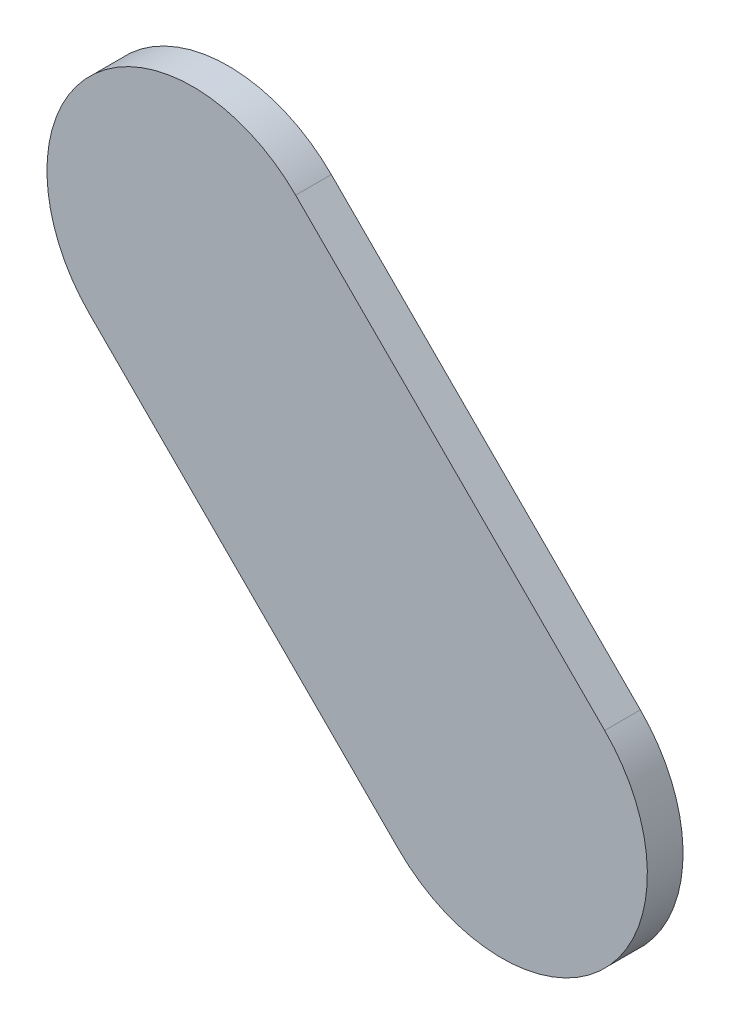
ISO-10303-21;
HEADER;
FILE_DESCRIPTION(('STEP AP214'),'2;1');
FILE_NAME('part.step','',(''),(''),'','','');
FILE_SCHEMA(('AUTOMOTIVE_DESIGN { 1 0 10303 214 1 1 1 1 }'));
ENDSEC;
DATA;
#1=APPLICATION_CONTEXT('core data for automotive mechanical design processes');
#2=APPLICATION_PROTOCOL_DEFINITION('international standard','automotive_design',2000,#1);
#3=PRODUCT_CONTEXT('',#1,'mechanical');
#4=PRODUCT('Part','Part','',(#3));
#5=PRODUCT_RELATED_PRODUCT_CATEGORY('part','',(#4));
#6=PRODUCT_DEFINITION_FORMATION('','',#4);
#7=PRODUCT_DEFINITION_CONTEXT('part definition',#1,'design');
#8=PRODUCT_DEFINITION('design','',#6,#7);
#9=PRODUCT_DEFINITION_SHAPE('','',#8);
#10=(LENGTH_UNIT() NAMED_UNIT(*) SI_UNIT(.MILLI.,.METRE.));
#11=(NAMED_UNIT(*) PLANE_ANGLE_UNIT() SI_UNIT($,.RADIAN.));
#12=(NAMED_UNIT(*) SI_UNIT($,.STERADIAN.) SOLID_ANGLE_UNIT());
#13=UNCERTAINTY_MEASURE_WITH_UNIT(LENGTH_MEASURE(1.E-05),#10,'distance_accuracy_value','');
#14=(GEOMETRIC_REPRESENTATION_CONTEXT(3) GLOBAL_UNCERTAINTY_ASSIGNED_CONTEXT((#13)) GLOBAL_UNIT_ASSIGNED_CONTEXT((#10,
#11,#12)) REPRESENTATION_CONTEXT('',''));
#15=CARTESIAN_POINT('',(0.,0.,0.));
#16=DIRECTION('',(0.,0.,1.));
#17=DIRECTION('',(1.,0.,0.));
#18=AXIS2_PLACEMENT_3D('',#15,#16,#17);
#19=CARTESIAN_POINT('',(3.018821666303,6.264377372288,0.76487));
#20=DIRECTION('',(0.,0.,-1.));
#21=DIRECTION('',(-1.,0.,0.));
#22=AXIS2_PLACEMENT_3D('',#19,#20,#21);
#23=PLANE('',#22);
#24=DIRECTION('',(0.707105987136602,-0.707107575235602,0.));
#25=VECTOR('',#24,1.);
#26=CARTESIAN_POINT('',(2.969431000001,6.511239,0.76487));
#27=LINE('',#26,#25);
#28=CARTESIAN_POINT('',(2.96943103026743,6.51123896973362,0.76487));
#29=VERTEX_POINT('',#28);
#30=CARTESIAN_POINT('',(3.26641555533316,6.21425377766617,0.76487));
#31=VERTEX_POINT('',#30);
#32=EDGE_CURVE('E54',#29,#31,#27,.T.);
#33=ORIENTED_EDGE('',*,*,#32,.T.);
#34=CARTESIAN_POINT('',(3.167420667,6.115258667,0.76487));
#35=DIRECTION('',(0.,0.,1.));
#36=DIRECTION('',(1.,0.,0.));
#37=AXIS2_PLACEMENT_3D('',#34,#35,#36);
#38=CIRCLE('',#37,0.140000070901);
#39=CARTESIAN_POINT('',(3.06842574790159,6.01626425310059,0.76487));
#40=VERTEX_POINT('',#39);
#41=EDGE_CURVE('E20',#40,#31,#38,.T.);
#42=ORIENTED_EDGE('',*,*,#41,.F.);
#43=DIRECTION('',(-0.707107575236102,0.707105987136102,0.));
#44=VECTOR('',#43,1.);
#45=CARTESIAN_POINT('',(3.068425667001,6.016264334001,0.76487));
#46=LINE('',#45,#44);
#47=CARTESIAN_POINT('',(2.77144055583361,6.31324877816655,0.76487));
#48=VERTEX_POINT('',#47);
#49=EDGE_CURVE('E78',#40,#48,#46,.T.);
#50=ORIENTED_EDGE('',*,*,#49,.T.);
#51=CARTESIAN_POINT('',(2.870435333,6.412244,0.76487));
#52=DIRECTION('',(0.,0.,1.));
#53=DIRECTION('',(1.,0.,0.));
#54=AXIS2_PLACEMENT_3D('',#51,#52,#53);
#55=CIRCLE('',#54,0.140000070901);
#56=EDGE_CURVE('E58',#29,#48,#55,.T.);
#57=ORIENTED_EDGE('',*,*,#56,.F.);
#58=EDGE_LOOP('',(#33,#42,#50,#57));
#59=FACE_BOUND('',#58,.T.);
#60=ADVANCED_FACE('F17',(#59),#23,.T.);
#61=CARTESIAN_POINT('',(3.167420667,6.115258667,0.76487));
#62=DIRECTION('',(0.,0.,1.));
#63=DIRECTION('',(1.,0.,0.));
#64=AXIS2_PLACEMENT_3D('',#61,#62,#63);
#65=CYLINDRICAL_SURFACE('',#64,0.140000070901);
#66=ORIENTED_EDGE('',*,*,#41,.T.);
#67=DIRECTION('',(0.,0.,1.));
#68=VECTOR('',#67,1.);
#69=CARTESIAN_POINT('',(3.26641533299991,6.21425399999992,0.76487));
#70=LINE('',#69,#68);
#71=CARTESIAN_POINT('',(3.26641555533319,6.21425377766623,0.79916));
#72=VERTEX_POINT('',#71);
#73=EDGE_CURVE('E62',#31,#72,#70,.T.);
#74=ORIENTED_EDGE('',*,*,#73,.T.);
#75=CARTESIAN_POINT('',(3.167420667001,6.115259232733,0.79916));
#76=DIRECTION('',(0.,0.,1.));
#77=DIRECTION('',(1.,0.,0.));
#78=AXIS2_PLACEMENT_3D('',#75,#76,#77);
#79=CIRCLE('',#78,0.14);
#80=CARTESIAN_POINT('',(3.06842574790162,6.01626425310056,0.79916));
#81=VERTEX_POINT('',#80);
#82=EDGE_CURVE('E82',#81,#72,#79,.T.);
#83=ORIENTED_EDGE('',*,*,#82,.F.);
#84=DIRECTION('',(0.,0.,1.));
#85=VECTOR('',#84,1.);
#86=CARTESIAN_POINT('',(3.068425667001,6.016264334001,0.76487));
#87=LINE('',#86,#85);
#88=EDGE_CURVE('E69',#81,#40,#87,.F.);
#89=ORIENTED_EDGE('',*,*,#88,.T.);
#90=EDGE_LOOP('',(#66,#74,#83,#89));
#91=FACE_BOUND('',#90,.T.);
#92=ADVANCED_FACE('F66',(#91),#65,.T.);
#93=CARTESIAN_POINT('',(2.969431000001,6.511239,0.76487));
#94=DIRECTION('',(-0.707107575235602,-0.707105987136602,0.));
#95=DIRECTION('',(0.707105987136602,-0.707107575235602,0.));
#96=AXIS2_PLACEMENT_3D('',#93,#94,#95);
#97=PLANE('',#96);
#98=ORIENTED_EDGE('',*,*,#73,.F.);
#99=ORIENTED_EDGE('',*,*,#32,.F.);
#100=DIRECTION('',(0.,0.,1.));
#101=VECTOR('',#100,1.);
#102=CARTESIAN_POINT('',(2.96943100000123,6.51123900000023,0.76487));
#103=LINE('',#102,#101);
#104=CARTESIAN_POINT('',(2.96943103026741,6.51123896973364,0.79916));
#105=VERTEX_POINT('',#104);
#106=EDGE_CURVE('E73',#105,#29,#103,.F.);
#107=ORIENTED_EDGE('',*,*,#106,.F.);
#108=DIRECTION('',(-0.707105987136807,0.707107575235396,0.));
#109=VECTOR('',#108,1.);
#110=CARTESIAN_POINT('',(3.266415333,6.214254,0.79916));
#111=LINE('',#110,#109);
#112=EDGE_CURVE('E72',#72,#105,#111,.T.);
#113=ORIENTED_EDGE('',*,*,#112,.F.);
#114=EDGE_LOOP('',(#98,#99,#107,#113));
#115=FACE_BOUND('',#114,.T.);
#116=ADVANCED_FACE('F71',(#115),#97,.F.);
#117=CARTESIAN_POINT('',(2.870435333,6.412244,0.76487));
#118=DIRECTION('',(0.,0.,1.));
#119=DIRECTION('',(1.,0.,0.));
#120=AXIS2_PLACEMENT_3D('',#117,#118,#119);
#121=CYLINDRICAL_SURFACE('',#120,0.140000070901);
#122=ORIENTED_EDGE('',*,*,#56,.T.);
#123=DIRECTION('',(0.,0.,1.));
#124=VECTOR('',#123,1.);
#125=CARTESIAN_POINT('',(2.7714406670002,6.3132486670002,0.76487));
#126=LINE('',#125,#124);
#127=CARTESIAN_POINT('',(2.77144055583349,6.31324877816636,0.79916));
#128=VERTEX_POINT('',#127);
#129=EDGE_CURVE('E79',#48,#128,#126,.T.);
#130=ORIENTED_EDGE('',*,*,#129,.T.);
#131=CARTESIAN_POINT('',(2.870435667,6.412243768268,0.79916));
#132=DIRECTION('',(0.,0.,1.));
#133=DIRECTION('',(1.,0.,0.));
#134=AXIS2_PLACEMENT_3D('',#131,#132,#133);
#135=CIRCLE('',#134,0.140000470934);
#136=EDGE_CURVE('E26',#105,#128,#135,.T.);
#137=ORIENTED_EDGE('',*,*,#136,.F.);
#138=ORIENTED_EDGE('',*,*,#106,.T.);
#139=EDGE_LOOP('',(#122,#130,#137,#138));
#140=FACE_BOUND('',#139,.T.);
#141=ADVANCED_FACE('F91',(#140),#121,.T.);
#142=CARTESIAN_POINT('',(3.068425667001,6.016264334001,0.76487));
#143=DIRECTION('',(0.707105987136102,0.707107575236102,0.));
#144=DIRECTION('',(-0.707107575236102,0.707105987136102,0.));
#145=AXIS2_PLACEMENT_3D('',#142,#143,#144);
#146=PLANE('',#145);
#147=ORIENTED_EDGE('',*,*,#129,.F.);
#148=ORIENTED_EDGE('',*,*,#49,.F.);
#149=ORIENTED_EDGE('',*,*,#88,.F.);
#150=DIRECTION('',(0.707107575236587,-0.707105987135616,0.));
#151=VECTOR('',#150,1.);
#152=CARTESIAN_POINT('',(2.771440667,6.313248667,0.79916));
#153=LINE('',#152,#151);
#154=EDGE_CURVE('E11',#128,#81,#153,.T.);
#155=ORIENTED_EDGE('',*,*,#154,.F.);
#156=EDGE_LOOP('',(#147,#148,#149,#155));
#157=FACE_BOUND('',#156,.T.);
#158=ADVANCED_FACE('F90',(#157),#146,.F.);
#159=CARTESIAN_POINT('',(3.018821666303,6.264377372288,0.79916));
#160=DIRECTION('',(0.,0.,1.));
#161=DIRECTION('',(1.,0.,0.));
#162=AXIS2_PLACEMENT_3D('',#159,#160,#161);
#163=PLANE('',#162);
#164=ORIENTED_EDGE('',*,*,#136,.T.);
#165=ORIENTED_EDGE('',*,*,#154,.T.);
#166=ORIENTED_EDGE('',*,*,#82,.T.);
#167=ORIENTED_EDGE('',*,*,#112,.T.);
#168=EDGE_LOOP('',(#164,#165,#166,#167));
#169=FACE_BOUND('',#168,.T.);
#170=ADVANCED_FACE('F87',(#169),#163,.T.);
#171=CLOSED_SHELL('',(#60,#92,#116,#141,#158,#170));
#172=MANIFOLD_SOLID_BREP('B1',#171);
#173=ADVANCED_BREP_SHAPE_REPRESENTATION('',(#18,#172),#14);
#174=SHAPE_DEFINITION_REPRESENTATION(#9,#173);
ENDSEC;
END-ISO-10303-21;
